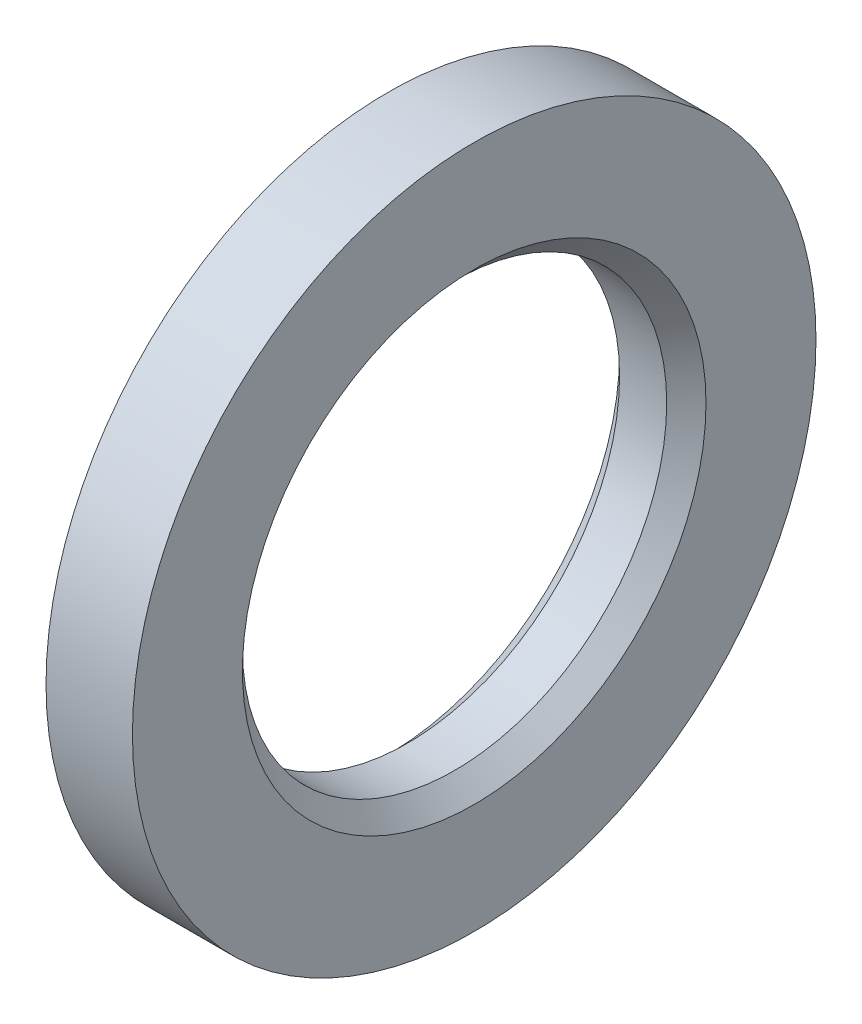
ISO-10303-21;
HEADER;
FILE_DESCRIPTION(('STEP AP214'),'2;1');
FILE_NAME('part.step','',(''),(''),'','','');
FILE_SCHEMA(('AUTOMOTIVE_DESIGN { 1 0 10303 214 1 1 1 1 }'));
ENDSEC;
DATA;
#1=APPLICATION_CONTEXT('core data for automotive mechanical design processes');
#2=APPLICATION_PROTOCOL_DEFINITION('international standard','automotive_design',2000,#1);
#3=PRODUCT_CONTEXT('',#1,'mechanical');
#4=PRODUCT('Part','Part','',(#3));
#5=PRODUCT_RELATED_PRODUCT_CATEGORY('part','',(#4));
#6=PRODUCT_DEFINITION_FORMATION('','',#4);
#7=PRODUCT_DEFINITION_CONTEXT('part definition',#1,'design');
#8=PRODUCT_DEFINITION('design','',#6,#7);
#9=PRODUCT_DEFINITION_SHAPE('','',#8);
#10=(LENGTH_UNIT() NAMED_UNIT(*) SI_UNIT(.MILLI.,.METRE.));
#11=(NAMED_UNIT(*) PLANE_ANGLE_UNIT() SI_UNIT($,.RADIAN.));
#12=(NAMED_UNIT(*) SI_UNIT($,.STERADIAN.) SOLID_ANGLE_UNIT());
#13=UNCERTAINTY_MEASURE_WITH_UNIT(LENGTH_MEASURE(1.E-05),#10,'distance_accuracy_value','');
#14=(GEOMETRIC_REPRESENTATION_CONTEXT(3) GLOBAL_UNCERTAINTY_ASSIGNED_CONTEXT((#13)) GLOBAL_UNIT_ASSIGNED_CONTEXT((#10,
#11,#12)) REPRESENTATION_CONTEXT('',''));
#15=CARTESIAN_POINT('',(0.,0.,0.));
#16=DIRECTION('',(0.,0.,1.));
#17=DIRECTION('',(1.,0.,0.));
#18=AXIS2_PLACEMENT_3D('',#15,#16,#17);
#19=CARTESIAN_POINT('',(-0.0635000000000045,0.,0.));
#20=DIRECTION('',(1.,0.,0.));
#21=DIRECTION('',(0.,0.,-1.));
#22=AXIS2_PLACEMENT_3D('',#19,#20,#21);
#23=CONICAL_SURFACE('',#22,0.6858,0.785398163397446);
#24=CARTESIAN_POINT('',(0.,0.,0.));
#25=DIRECTION('',(1.,0.,0.));
#26=DIRECTION('',(0.,0.,-1.));
#27=AXIS2_PLACEMENT_3D('',#24,#25,#26);
#28=CIRCLE('',#27,0.7493);
#29=CARTESIAN_POINT('',(0.,0.,-0.7493));
#30=VERTEX_POINT('',#29);
#31=EDGE_CURVE('E67',#30,#30,#28,.T.);
#32=ORIENTED_EDGE('',*,*,#31,.T.);
#33=EDGE_LOOP('',(#32));
#34=FACE_BOUND('',#33,.T.);
#35=CARTESIAN_POINT('',(-0.0635000000000045,0.,0.));
#36=DIRECTION('',(1.,0.,0.));
#37=DIRECTION('',(0.,0.,-1.));
#38=AXIS2_PLACEMENT_3D('',#35,#36,#37);
#39=CIRCLE('',#38,0.6858);
#40=CARTESIAN_POINT('',(-0.0635000000000044,0.,-0.6858));
#41=VERTEX_POINT('',#40);
#42=EDGE_CURVE('E10',#41,#41,#39,.T.);
#43=ORIENTED_EDGE('',*,*,#42,.F.);
#44=EDGE_LOOP('',(#43));
#45=FACE_BOUND('',#44,.T.);
#46=ADVANCED_FACE('F38',(#34,#45),#23,.F.);
#47=CARTESIAN_POINT('',(-0.279400000000003,0.,0.));
#48=DIRECTION('',(1.,0.,0.));
#49=DIRECTION('',(0.,0.,-1.));
#50=AXIS2_PLACEMENT_3D('',#47,#48,#49);
#51=CYLINDRICAL_SURFACE('',#50,0.6858);
#52=ORIENTED_EDGE('',*,*,#42,.T.);
#53=EDGE_LOOP('',(#52));
#54=FACE_BOUND('',#53,.T.);
#55=CARTESIAN_POINT('',(-0.215900000000008,0.,0.));
#56=DIRECTION('',(1.,0.,0.));
#57=DIRECTION('',(0.,0.,-1.));
#58=AXIS2_PLACEMENT_3D('',#55,#56,#57);
#59=CIRCLE('',#58,0.6858);
#60=CARTESIAN_POINT('',(-0.215900000000008,0.,-0.685800000000003));
#61=VERTEX_POINT('',#60);
#62=EDGE_CURVE('E45',#61,#61,#59,.T.);
#63=ORIENTED_EDGE('',*,*,#62,.F.);
#64=EDGE_LOOP('',(#63));
#65=FACE_BOUND('',#64,.T.);
#66=ADVANCED_FACE('F87',(#54,#65),#51,.F.);
#67=CARTESIAN_POINT('',(-0.279400000000003,0.,0.));
#68=DIRECTION('',(-1.,0.,0.));
#69=DIRECTION('',(0.,0.,1.));
#70=AXIS2_PLACEMENT_3D('',#67,#68,#69);
#71=CONICAL_SURFACE('',#70,0.7493,0.785398163397448);
#72=ORIENTED_EDGE('',*,*,#62,.T.);
#73=EDGE_LOOP('',(#72));
#74=FACE_BOUND('',#73,.T.);
#75=CARTESIAN_POINT('',(-0.279400000000003,0.,0.));
#76=DIRECTION('',(1.,0.,0.));
#77=DIRECTION('',(0.,0.,-1.));
#78=AXIS2_PLACEMENT_3D('',#75,#76,#77);
#79=CIRCLE('',#78,0.7493);
#80=CARTESIAN_POINT('',(-0.279400000000002,0.,-0.749299999999996));
#81=VERTEX_POINT('',#80);
#82=EDGE_CURVE('E51',#81,#81,#79,.T.);
#83=ORIENTED_EDGE('',*,*,#82,.F.);
#84=EDGE_LOOP('',(#83));
#85=FACE_BOUND('',#84,.T.);
#86=ADVANCED_FACE('F91',(#74,#85),#71,.F.);
#87=CARTESIAN_POINT('',(-0.279399999999999,1.10489999999999,0.));
#88=DIRECTION('',(-1.,0.,0.));
#89=DIRECTION('',(0.,0.,1.));
#90=AXIS2_PLACEMENT_3D('',#87,#88,#89);
#91=PLANE('',#90);
#92=ORIENTED_EDGE('',*,*,#82,.T.);
#93=EDGE_LOOP('',(#92));
#94=FACE_BOUND('',#93,.T.);
#95=CARTESIAN_POINT('',(-0.279400000000003,0.,0.));
#96=DIRECTION('',(1.,0.,0.));
#97=DIRECTION('',(0.,0.,-1.));
#98=AXIS2_PLACEMENT_3D('',#95,#96,#97);
#99=CIRCLE('',#98,1.1049);
#100=CARTESIAN_POINT('',(-0.279400000000002,0.,-1.1049));
#101=VERTEX_POINT('',#100);
#102=EDGE_CURVE('E57',#101,#101,#99,.T.);
#103=ORIENTED_EDGE('',*,*,#102,.F.);
#104=EDGE_LOOP('',(#103));
#105=FACE_BOUND('',#104,.T.);
#106=ADVANCED_FACE('F83',(#94,#105),#91,.T.);
#107=CARTESIAN_POINT('',(-0.279400000000003,0.,0.));
#108=DIRECTION('',(1.,0.,0.));
#109=DIRECTION('',(0.,0.,-1.));
#110=AXIS2_PLACEMENT_3D('',#107,#108,#109);
#111=CYLINDRICAL_SURFACE('',#110,1.1049);
#112=ORIENTED_EDGE('',*,*,#102,.T.);
#113=EDGE_LOOP('',(#112));
#114=FACE_BOUND('',#113,.T.);
#115=CARTESIAN_POINT('',(0.,0.,0.));
#116=DIRECTION('',(1.,0.,0.));
#117=DIRECTION('',(0.,0.,-1.));
#118=AXIS2_PLACEMENT_3D('',#115,#116,#117);
#119=CIRCLE('',#118,1.1049);
#120=CARTESIAN_POINT('',(0.,0.,-1.1049));
#121=VERTEX_POINT('',#120);
#122=EDGE_CURVE('E63',#121,#121,#119,.T.);
#123=ORIENTED_EDGE('',*,*,#122,.F.);
#124=EDGE_LOOP('',(#123));
#125=FACE_BOUND('',#124,.T.);
#126=ADVANCED_FACE('F77',(#114,#125),#111,.T.);
#127=CARTESIAN_POINT('',(0.,0.749299999999994,0.));
#128=DIRECTION('',(1.,0.,0.));
#129=DIRECTION('',(0.,0.,-1.));
#130=AXIS2_PLACEMENT_3D('',#127,#128,#129);
#131=PLANE('',#130);
#132=ORIENTED_EDGE('',*,*,#122,.T.);
#133=EDGE_LOOP('',(#132));
#134=FACE_BOUND('',#133,.T.);
#135=ORIENTED_EDGE('',*,*,#31,.F.);
#136=EDGE_LOOP('',(#135));
#137=FACE_BOUND('',#136,.T.);
#138=ADVANCED_FACE('F75',(#134,#137),#131,.T.);
#139=CLOSED_SHELL('',(#46,#66,#86,#106,#126,#138));
#140=MANIFOLD_SOLID_BREP('B2',#139);
#141=ADVANCED_BREP_SHAPE_REPRESENTATION('',(#18,#140),#14);
#142=SHAPE_DEFINITION_REPRESENTATION(#9,#141);
ENDSEC;
END-ISO-10303-21;
